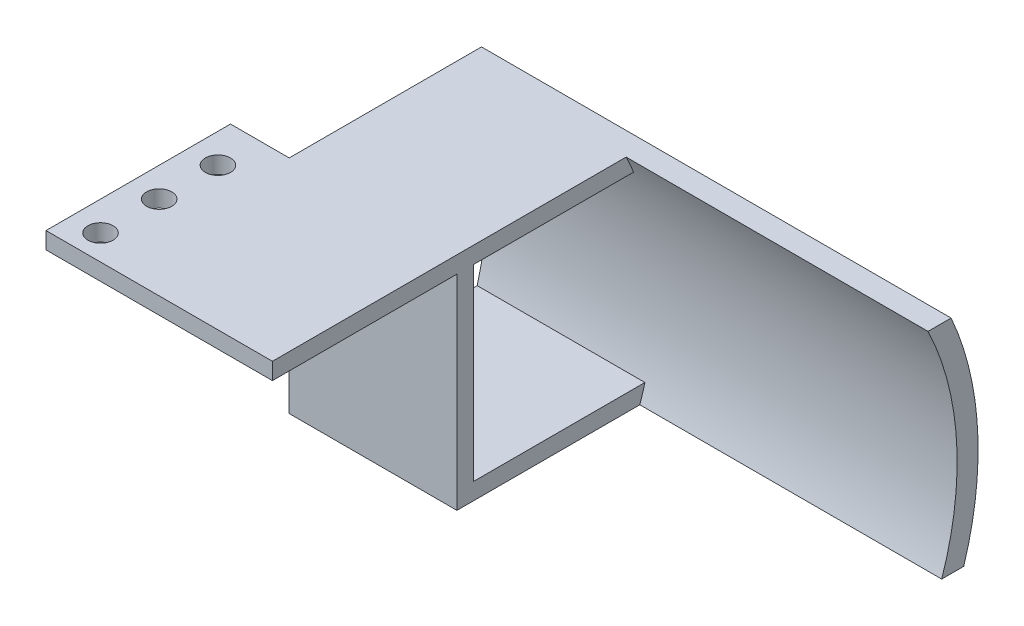
ISO-10303-21;
HEADER;
FILE_DESCRIPTION(('STEP AP214'),'2;1');
FILE_NAME('part.step','',(''),(''),'','','');
FILE_SCHEMA(('AUTOMOTIVE_DESIGN { 1 0 10303 214 1 1 1 1 }'));
ENDSEC;
DATA;
#1=APPLICATION_CONTEXT('core data for automotive mechanical design processes');
#2=APPLICATION_PROTOCOL_DEFINITION('international standard','automotive_design',2000,#1);
#3=PRODUCT_CONTEXT('',#1,'mechanical');
#4=PRODUCT('Part','Part','',(#3));
#5=PRODUCT_RELATED_PRODUCT_CATEGORY('part','',(#4));
#6=PRODUCT_DEFINITION_FORMATION('','',#4);
#7=PRODUCT_DEFINITION_CONTEXT('part definition',#1,'design');
#8=PRODUCT_DEFINITION('design','',#6,#7);
#9=PRODUCT_DEFINITION_SHAPE('','',#8);
#10=(LENGTH_UNIT() NAMED_UNIT(*) SI_UNIT(.MILLI.,.METRE.));
#11=(NAMED_UNIT(*) PLANE_ANGLE_UNIT() SI_UNIT($,.RADIAN.));
#12=(NAMED_UNIT(*) SI_UNIT($,.STERADIAN.) SOLID_ANGLE_UNIT());
#13=UNCERTAINTY_MEASURE_WITH_UNIT(LENGTH_MEASURE(1.E-05),#10,'distance_accuracy_value','');
#14=(GEOMETRIC_REPRESENTATION_CONTEXT(3) GLOBAL_UNCERTAINTY_ASSIGNED_CONTEXT((#13)) GLOBAL_UNIT_ASSIGNED_CONTEXT((#10,
#11,#12)) REPRESENTATION_CONTEXT('',''));
#15=CARTESIAN_POINT('',(0.,0.,0.));
#16=DIRECTION('',(0.,0.,1.));
#17=DIRECTION('',(1.,0.,0.));
#18=AXIS2_PLACEMENT_3D('',#15,#16,#17);
#19=CARTESIAN_POINT('',(0.,15.2,0.));
#20=DIRECTION('',(0.,-1.,0.));
#21=DIRECTION('',(0.,0.,-1.));
#22=AXIS2_PLACEMENT_3D('',#19,#20,#21);
#23=PLANE('',#22);
#24=DIRECTION('',(0.,0.,1.));
#25=VECTOR('',#24,1.);
#26=CARTESIAN_POINT('',(21.,15.2,-49.8500000000001));
#27=LINE('',#26,#25);
#28=CARTESIAN_POINT('',(21.,15.2,-71.8500000000001));
#29=VERTEX_POINT('',#28);
#30=CARTESIAN_POINT('',(21.,15.2,-49.8500000000001));
#31=VERTEX_POINT('',#30);
#32=EDGE_CURVE('E247',#29,#31,#27,.T.);
#33=ORIENTED_EDGE('',*,*,#32,.T.);
#34=DIRECTION('',(1.,0.,0.));
#35=VECTOR('',#34,1.);
#36=CARTESIAN_POINT('',(21.,15.2,-49.8500000000001));
#37=LINE('',#36,#35);
#38=CARTESIAN_POINT('',(48.,15.2,-49.8500000000001));
#39=VERTEX_POINT('',#38);
#40=EDGE_CURVE('E85',#31,#39,#37,.T.);
#41=ORIENTED_EDGE('',*,*,#40,.T.);
#42=DIRECTION('',(0.,0.,-1.));
#43=VECTOR('',#42,1.);
#44=CARTESIAN_POINT('',(48.,15.2,-49.8500000000001));
#45=LINE('',#44,#43);
#46=CARTESIAN_POINT('',(48.,15.2,-92.027131173007));
#47=VERTEX_POINT('',#46);
#48=EDGE_CURVE('E251',#39,#47,#45,.T.);
#49=ORIENTED_EDGE('',*,*,#48,.T.);
#50=DIRECTION('',(-1.,0.,0.));
#51=VECTOR('',#50,1.);
#52=CARTESIAN_POINT('',(84.,15.2,-92.027131173007));
#53=LINE('',#52,#51);
#54=CARTESIAN_POINT('',(84.,15.2,-92.027131173007));
#55=VERTEX_POINT('',#54);
#56=EDGE_CURVE('E168',#55,#47,#53,.T.);
#57=ORIENTED_EDGE('',*,*,#56,.F.);
#58=DIRECTION('',(0.,0.,-1.));
#59=VECTOR('',#58,1.);
#60=CARTESIAN_POINT('',(84.,15.2,0.));
#61=LINE('',#60,#59);
#62=CARTESIAN_POINT('',(84.,15.2,-94.781336029974));
#63=VERTEX_POINT('',#62);
#64=EDGE_CURVE('E161',#55,#63,#61,.T.);
#65=ORIENTED_EDGE('',*,*,#64,.T.);
#66=DIRECTION('',(-1.,0.,0.));
#67=VECTOR('',#66,1.);
#68=CARTESIAN_POINT('',(84.,15.2,-94.781336029974));
#69=LINE('',#68,#67);
#70=CARTESIAN_POINT('',(28.,15.2,-94.781336029974));
#71=VERTEX_POINT('',#70);
#72=EDGE_CURVE('E147',#63,#71,#69,.T.);
#73=ORIENTED_EDGE('',*,*,#72,.T.);
#74=DIRECTION('',(0.,0.,-1.));
#75=VECTOR('',#74,1.);
#76=CARTESIAN_POINT('',(28.,15.2,0.));
#77=LINE('',#76,#75);
#78=CARTESIAN_POINT('',(28.,15.2,-71.8500000000001));
#79=VERTEX_POINT('',#78);
#80=EDGE_CURVE('E178',#79,#71,#77,.T.);
#81=ORIENTED_EDGE('',*,*,#80,.F.);
#82=DIRECTION('',(-1.,0.,0.));
#83=VECTOR('',#82,1.);
#84=CARTESIAN_POINT('',(21.,15.2,-71.8500000000001));
#85=LINE('',#84,#83);
#86=EDGE_CURVE('E62',#79,#29,#85,.T.);
#87=ORIENTED_EDGE('',*,*,#86,.T.);
#88=EDGE_LOOP('',(#33,#41,#49,#57,#65,#73,#81,#87));
#89=FACE_BOUND('',#88,.T.);
#90=CARTESIAN_POINT('',(24.5,15.2,-59.8500000000001));
#91=DIRECTION('',(0.,1.,0.));
#92=DIRECTION('',(0.,0.,1.));
#93=AXIS2_PLACEMENT_3D('',#90,#91,#92);
#94=CIRCLE('',#93,1.5);
#95=CARTESIAN_POINT('',(24.5,15.2,-58.3500000000001));
#96=VERTEX_POINT('',#95);
#97=EDGE_CURVE('E241',#96,#96,#94,.T.);
#98=ORIENTED_EDGE('',*,*,#97,.F.);
#99=EDGE_LOOP('',(#98));
#100=FACE_BOUND('',#99,.T.);
#101=CARTESIAN_POINT('',(24.5,15.2,-66.8500000000001));
#102=DIRECTION('',(0.,1.,0.));
#103=DIRECTION('',(0.,0.,1.));
#104=AXIS2_PLACEMENT_3D('',#101,#102,#103);
#105=CIRCLE('',#104,1.5);
#106=CARTESIAN_POINT('',(24.5,15.2,-65.3500000000001));
#107=VERTEX_POINT('',#106);
#108=EDGE_CURVE('E235',#107,#107,#105,.T.);
#109=ORIENTED_EDGE('',*,*,#108,.F.);
#110=EDGE_LOOP('',(#109));
#111=FACE_BOUND('',#110,.T.);
#112=CARTESIAN_POINT('',(24.5,15.2,-52.8500000000001));
#113=DIRECTION('',(0.,1.,0.));
#114=DIRECTION('',(0.,0.,1.));
#115=AXIS2_PLACEMENT_3D('',#112,#113,#114);
#116=CIRCLE('',#115,1.5);
#117=CARTESIAN_POINT('',(24.5,15.2,-51.3500000000001));
#118=VERTEX_POINT('',#117);
#119=EDGE_CURVE('E229',#118,#118,#116,.T.);
#120=ORIENTED_EDGE('',*,*,#119,.F.);
#121=EDGE_LOOP('',(#120));
#122=FACE_BOUND('',#121,.T.);
#123=ADVANCED_FACE('F38',(#89,#100,#111,#122),#23,.F.);
#124=CARTESIAN_POINT('',(0.,13.2,0.));
#125=DIRECTION('',(0.,-1.,0.));
#126=DIRECTION('',(0.,0.,-1.));
#127=AXIS2_PLACEMENT_3D('',#124,#125,#126);
#128=PLANE('',#127);
#129=CARTESIAN_POINT('',(24.5,13.2,-66.8500000000001));
#130=DIRECTION('',(0.,1.,0.));
#131=DIRECTION('',(0.,0.,1.));
#132=AXIS2_PLACEMENT_3D('',#129,#130,#131);
#133=CIRCLE('',#132,1.5);
#134=CARTESIAN_POINT('',(24.5,13.2,-65.3500000000001));
#135=VERTEX_POINT('',#134);
#136=EDGE_CURVE('E232',#135,#135,#133,.T.);
#137=ORIENTED_EDGE('',*,*,#136,.T.);
#138=EDGE_LOOP('',(#137));
#139=FACE_BOUND('',#138,.T.);
#140=DIRECTION('',(0.,0.,1.));
#141=VECTOR('',#140,1.);
#142=CARTESIAN_POINT('',(21.,13.2,-49.8500000000001));
#143=LINE('',#142,#141);
#144=CARTESIAN_POINT('',(21.,13.2,-71.8500000000001));
#145=VERTEX_POINT('',#144);
#146=CARTESIAN_POINT('',(21.,13.2,-49.8500000000001));
#147=VERTEX_POINT('',#146);
#148=EDGE_CURVE('E244',#145,#147,#143,.T.);
#149=ORIENTED_EDGE('',*,*,#148,.F.);
#150=DIRECTION('',(-1.,0.,0.));
#151=VECTOR('',#150,1.);
#152=CARTESIAN_POINT('',(21.,13.2,-71.8500000000001));
#153=LINE('',#152,#151);
#154=CARTESIAN_POINT('',(28.,13.2,-71.8500000000001));
#155=VERTEX_POINT('',#154);
#156=EDGE_CURVE('E80',#155,#145,#153,.T.);
#157=ORIENTED_EDGE('',*,*,#156,.F.);
#158=CARTESIAN_POINT('',(48.,13.2,-71.8500000000001));
#159=VERTEX_POINT('',#158);
#160=EDGE_CURVE('E249',#159,#155,#153,.T.);
#161=ORIENTED_EDGE('',*,*,#160,.F.);
#162=DIRECTION('',(0.,0.,-1.));
#163=VECTOR('',#162,1.);
#164=CARTESIAN_POINT('',(48.,13.2,-49.8500000000001));
#165=LINE('',#164,#163);
#166=CARTESIAN_POINT('',(48.,13.2,-49.8500000000001));
#167=VERTEX_POINT('',#166);
#168=EDGE_CURVE('E259',#167,#159,#165,.T.);
#169=ORIENTED_EDGE('',*,*,#168,.F.);
#170=DIRECTION('',(1.,0.,0.));
#171=VECTOR('',#170,1.);
#172=CARTESIAN_POINT('',(21.,13.2,-49.8500000000001));
#173=LINE('',#172,#171);
#174=EDGE_CURVE('E257',#147,#167,#173,.T.);
#175=ORIENTED_EDGE('',*,*,#174,.F.);
#176=EDGE_LOOP('',(#149,#157,#161,#169,#175));
#177=FACE_BOUND('',#176,.T.);
#178=CARTESIAN_POINT('',(24.5,13.2,-59.8500000000001));
#179=DIRECTION('',(0.,1.,0.));
#180=DIRECTION('',(0.,0.,1.));
#181=AXIS2_PLACEMENT_3D('',#178,#179,#180);
#182=CIRCLE('',#181,1.5);
#183=CARTESIAN_POINT('',(24.5,13.2,-58.3500000000001));
#184=VERTEX_POINT('',#183);
#185=EDGE_CURVE('E238',#184,#184,#182,.T.);
#186=ORIENTED_EDGE('',*,*,#185,.T.);
#187=EDGE_LOOP('',(#186));
#188=FACE_BOUND('',#187,.T.);
#189=CARTESIAN_POINT('',(24.5,13.2,-52.8500000000001));
#190=DIRECTION('',(0.,1.,0.));
#191=DIRECTION('',(0.,0.,1.));
#192=AXIS2_PLACEMENT_3D('',#189,#190,#191);
#193=CIRCLE('',#192,1.5);
#194=CARTESIAN_POINT('',(24.5,13.2,-51.3500000000001));
#195=VERTEX_POINT('',#194);
#196=EDGE_CURVE('E219',#195,#195,#193,.T.);
#197=ORIENTED_EDGE('',*,*,#196,.T.);
#198=EDGE_LOOP('',(#197));
#199=FACE_BOUND('',#198,.T.);
#200=ADVANCED_FACE('F272',(#139,#177,#188,#199),#128,.T.);
#201=CARTESIAN_POINT('',(21.,15.2,-49.8500000000001));
#202=DIRECTION('',(1.,0.,0.));
#203=DIRECTION('',(0.,0.,-1.));
#204=AXIS2_PLACEMENT_3D('',#201,#202,#203);
#205=PLANE('',#204);
#206=ORIENTED_EDGE('',*,*,#148,.T.);
#207=DIRECTION('',(0.,-1.,0.));
#208=VECTOR('',#207,1.);
#209=CARTESIAN_POINT('',(21.,15.2,-49.8500000000001));
#210=LINE('',#209,#208);
#211=EDGE_CURVE('E11',#31,#147,#210,.T.);
#212=ORIENTED_EDGE('',*,*,#211,.F.);
#213=ORIENTED_EDGE('',*,*,#32,.F.);
#214=DIRECTION('',(0.,-1.,0.));
#215=VECTOR('',#214,1.);
#216=CARTESIAN_POINT('',(21.,15.2,-71.8500000000001));
#217=LINE('',#216,#215);
#218=EDGE_CURVE('E254',#29,#145,#217,.T.);
#219=ORIENTED_EDGE('',*,*,#218,.T.);
#220=EDGE_LOOP('',(#206,#212,#213,#219));
#221=FACE_BOUND('',#220,.T.);
#222=ADVANCED_FACE('F40',(#221),#205,.F.);
#223=CARTESIAN_POINT('',(21.,15.2,-49.8500000000001));
#224=DIRECTION('',(0.,0.,-1.));
#225=DIRECTION('',(0.,1.,0.));
#226=AXIS2_PLACEMENT_3D('',#223,#224,#225);
#227=PLANE('',#226);
#228=ORIENTED_EDGE('',*,*,#174,.T.);
#229=DIRECTION('',(0.,-1.,0.));
#230=VECTOR('',#229,1.);
#231=CARTESIAN_POINT('',(48.,15.2,-49.8500000000001));
#232=LINE('',#231,#230);
#233=EDGE_CURVE('E46',#39,#167,#232,.T.);
#234=ORIENTED_EDGE('',*,*,#233,.F.);
#235=ORIENTED_EDGE('',*,*,#40,.F.);
#236=ORIENTED_EDGE('',*,*,#211,.T.);
#237=EDGE_LOOP('',(#228,#234,#235,#236));
#238=FACE_BOUND('',#237,.T.);
#239=ADVANCED_FACE('F302',(#238),#227,.F.);
#240=CARTESIAN_POINT('',(48.,15.2,-49.8500000000001));
#241=DIRECTION('',(-1.,0.,0.));
#242=DIRECTION('',(0.,0.,1.));
#243=AXIS2_PLACEMENT_3D('',#240,#241,#242);
#244=PLANE('',#243);
#245=ORIENTED_EDGE('',*,*,#168,.T.);
#246=DIRECTION('',(0.,-1.,0.));
#247=VECTOR('',#246,1.);
#248=CARTESIAN_POINT('',(48.,0.,-71.8500000000001));
#249=LINE('',#248,#247);
#250=CARTESIAN_POINT('',(48.,-11.2,-71.8500000000001));
#251=VERTEX_POINT('',#250);
#252=EDGE_CURVE('E200',#159,#251,#249,.T.);
#253=ORIENTED_EDGE('',*,*,#252,.T.);
#254=DIRECTION('',(0.,0.,-1.));
#255=VECTOR('',#254,1.);
#256=CARTESIAN_POINT('',(48.,-11.2,0.));
#257=LINE('',#256,#255);
#258=CARTESIAN_POINT('',(48.,-11.2,-93.6596139905156));
#259=VERTEX_POINT('',#258);
#260=EDGE_CURVE('E197',#251,#259,#257,.T.);
#261=ORIENTED_EDGE('',*,*,#260,.T.);
#262=CARTESIAN_POINT('',(48.,-1.67790586170717E-13,-60.4999999999999));
#263=DIRECTION('',(-1.,0.,0.));
#264=DIRECTION('',(0.,-1.,0.));
#265=AXIS2_PLACEMENT_3D('',#262,#263,#264);
#266=CIRCLE('',#265,35.);
#267=CARTESIAN_POINT('',(48.,-9.20000000000031,-94.269216751355));
#268=VERTEX_POINT('',#267);
#269=EDGE_CURVE('E195',#268,#259,#266,.T.);
#270=ORIENTED_EDGE('',*,*,#269,.F.);
#271=DIRECTION('',(0.,0.,-1.));
#272=VECTOR('',#271,1.);
#273=CARTESIAN_POINT('',(48.,-9.2000000000003,0.));
#274=LINE('',#273,#272);
#275=CARTESIAN_POINT('',(48.,-9.20000000000031,-73.8500000000001));
#276=VERTEX_POINT('',#275);
#277=EDGE_CURVE('E192',#276,#268,#274,.T.);
#278=ORIENTED_EDGE('',*,*,#277,.F.);
#279=DIRECTION('',(0.,-1.,0.));
#280=VECTOR('',#279,1.);
#281=CARTESIAN_POINT('',(48.,0.,-73.8500000000001));
#282=LINE('',#281,#280);
#283=CARTESIAN_POINT('',(48.,13.2,-73.8500000000001));
#284=VERTEX_POINT('',#283);
#285=EDGE_CURVE('E189',#284,#276,#282,.T.);
#286=ORIENTED_EDGE('',*,*,#285,.F.);
#287=DIRECTION('',(0.,0.,-1.));
#288=VECTOR('',#287,1.);
#289=CARTESIAN_POINT('',(48.,13.2,0.));
#290=LINE('',#289,#288);
#291=CARTESIAN_POINT('',(48.,13.2,-92.9154284253655));
#292=VERTEX_POINT('',#291);
#293=EDGE_CURVE('E185',#284,#292,#290,.T.);
#294=ORIENTED_EDGE('',*,*,#293,.T.);
#295=CARTESIAN_POINT('',(48.,-1.67790586170717E-13,-60.4999999999999));
#296=DIRECTION('',(-1.,0.,0.));
#297=DIRECTION('',(0.,-1.,0.));
#298=AXIS2_PLACEMENT_3D('',#295,#296,#297);
#299=CIRCLE('',#298,35.);
#300=EDGE_CURVE('E183',#47,#292,#299,.T.);
#301=ORIENTED_EDGE('',*,*,#300,.F.);
#302=ORIENTED_EDGE('',*,*,#48,.F.);
#303=ORIENTED_EDGE('',*,*,#233,.T.);
#304=EDGE_LOOP('',(#245,#253,#261,#270,#278,#286,#294,#301,#302,#303));
#305=FACE_BOUND('',#304,.T.);
#306=ADVANCED_FACE('F267',(#305),#244,.F.);
#307=CARTESIAN_POINT('',(21.,15.2,-71.8500000000001));
#308=DIRECTION('',(0.,0.,1.));
#309=DIRECTION('',(0.,-1.,0.));
#310=AXIS2_PLACEMENT_3D('',#307,#308,#309);
#311=PLANE('',#310);
#312=ORIENTED_EDGE('',*,*,#86,.F.);
#313=DIRECTION('',(0.,-1.,0.));
#314=VECTOR('',#313,1.);
#315=CARTESIAN_POINT('',(28.,0.,-71.8500000000001));
#316=LINE('',#315,#314);
#317=EDGE_CURVE('E186',#79,#155,#316,.T.);
#318=ORIENTED_EDGE('',*,*,#317,.T.);
#319=ORIENTED_EDGE('',*,*,#156,.T.);
#320=ORIENTED_EDGE('',*,*,#218,.F.);
#321=EDGE_LOOP('',(#312,#318,#319,#320));
#322=FACE_BOUND('',#321,.T.);
#323=ADVANCED_FACE('F277',(#322),#311,.F.);
#324=CARTESIAN_POINT('',(24.5,15.2,-59.8500000000001));
#325=DIRECTION('',(0.,-1.,0.));
#326=DIRECTION('',(0.,0.,-1.));
#327=AXIS2_PLACEMENT_3D('',#324,#325,#326);
#328=CYLINDRICAL_SURFACE('',#327,1.5);
#329=ORIENTED_EDGE('',*,*,#97,.T.);
#330=EDGE_LOOP('',(#329));
#331=FACE_BOUND('',#330,.T.);
#332=ORIENTED_EDGE('',*,*,#185,.F.);
#333=EDGE_LOOP('',(#332));
#334=FACE_BOUND('',#333,.T.);
#335=ADVANCED_FACE('F317',(#331,#334),#328,.F.);
#336=CARTESIAN_POINT('',(24.5,15.2,-66.8500000000001));
#337=DIRECTION('',(0.,-1.,0.));
#338=DIRECTION('',(0.,0.,-1.));
#339=AXIS2_PLACEMENT_3D('',#336,#337,#338);
#340=CYLINDRICAL_SURFACE('',#339,1.5);
#341=ORIENTED_EDGE('',*,*,#108,.T.);
#342=EDGE_LOOP('',(#341));
#343=FACE_BOUND('',#342,.T.);
#344=ORIENTED_EDGE('',*,*,#136,.F.);
#345=EDGE_LOOP('',(#344));
#346=FACE_BOUND('',#345,.T.);
#347=ADVANCED_FACE('F324',(#343,#346),#340,.F.);
#348=CARTESIAN_POINT('',(24.5,15.2,-52.8500000000001));
#349=DIRECTION('',(0.,-1.,0.));
#350=DIRECTION('',(0.,0.,-1.));
#351=AXIS2_PLACEMENT_3D('',#348,#349,#350);
#352=CYLINDRICAL_SURFACE('',#351,1.5);
#353=ORIENTED_EDGE('',*,*,#119,.T.);
#354=EDGE_LOOP('',(#353));
#355=FACE_BOUND('',#354,.T.);
#356=ORIENTED_EDGE('',*,*,#196,.F.);
#357=EDGE_LOOP('',(#356));
#358=FACE_BOUND('',#357,.T.);
#359=ADVANCED_FACE('F329',(#355,#358),#352,.F.);
#360=CARTESIAN_POINT('',(48.,0.,-71.8500000000001));
#361=DIRECTION('',(0.,0.,-1.));
#362=DIRECTION('',(-1.,0.,0.));
#363=AXIS2_PLACEMENT_3D('',#360,#361,#362);
#364=PLANE('',#363);
#365=ORIENTED_EDGE('',*,*,#252,.F.);
#366=ORIENTED_EDGE('',*,*,#160,.T.);
#367=CARTESIAN_POINT('',(28.,-11.2,-71.8500000000001));
#368=VERTEX_POINT('',#367);
#369=EDGE_CURVE('E53',#155,#368,#316,.T.);
#370=ORIENTED_EDGE('',*,*,#369,.T.);
#371=DIRECTION('',(-1.,0.,0.));
#372=VECTOR('',#371,1.);
#373=CARTESIAN_POINT('',(48.,-11.2,-71.8500000000001));
#374=LINE('',#373,#372);
#375=EDGE_CURVE('E216',#251,#368,#374,.T.);
#376=ORIENTED_EDGE('',*,*,#375,.F.);
#377=EDGE_LOOP('',(#365,#366,#370,#376));
#378=FACE_BOUND('',#377,.T.);
#379=ADVANCED_FACE('F275',(#378),#364,.F.);
#380=CARTESIAN_POINT('',(48.,-11.2,0.));
#381=DIRECTION('',(0.,1.,0.));
#382=DIRECTION('',(-1.,0.,0.));
#383=AXIS2_PLACEMENT_3D('',#380,#381,#382);
#384=PLANE('',#383);
#385=DIRECTION('',(0.,0.,-1.));
#386=VECTOR('',#385,1.);
#387=CARTESIAN_POINT('',(28.,-11.2,0.));
#388=LINE('',#387,#386);
#389=CARTESIAN_POINT('',(28.,-11.2,-96.2884059438248));
#390=VERTEX_POINT('',#389);
#391=EDGE_CURVE('E213',#368,#390,#388,.T.);
#392=ORIENTED_EDGE('',*,*,#391,.T.);
#393=DIRECTION('',(-1.,0.,0.));
#394=VECTOR('',#393,1.);
#395=CARTESIAN_POINT('',(84.,-11.2,-96.2884059438248));
#396=LINE('',#395,#394);
#397=CARTESIAN_POINT('',(84.,-11.2,-96.2884059438248));
#398=VERTEX_POINT('',#397);
#399=EDGE_CURVE('E155',#398,#390,#396,.T.);
#400=ORIENTED_EDGE('',*,*,#399,.F.);
#401=DIRECTION('',(0.,0.,-1.));
#402=VECTOR('',#401,1.);
#403=CARTESIAN_POINT('',(84.,-11.2,0.));
#404=LINE('',#403,#402);
#405=CARTESIAN_POINT('',(84.,-11.2,-93.6596139905156));
#406=VERTEX_POINT('',#405);
#407=EDGE_CURVE('E163',#406,#398,#404,.T.);
#408=ORIENTED_EDGE('',*,*,#407,.F.);
#409=DIRECTION('',(-1.,0.,0.));
#410=VECTOR('',#409,1.);
#411=CARTESIAN_POINT('',(84.,-11.2,-93.6596139905156));
#412=LINE('',#411,#410);
#413=EDGE_CURVE('E179',#406,#259,#412,.T.);
#414=ORIENTED_EDGE('',*,*,#413,.T.);
#415=ORIENTED_EDGE('',*,*,#260,.F.);
#416=ORIENTED_EDGE('',*,*,#375,.T.);
#417=EDGE_LOOP('',(#392,#400,#408,#414,#415,#416));
#418=FACE_BOUND('',#417,.T.);
#419=ADVANCED_FACE('F280',(#418),#384,.F.);
#420=CARTESIAN_POINT('',(48.,-9.2000000000003,0.));
#421=DIRECTION('',(0.,1.,0.));
#422=DIRECTION('',(-1.,0.,0.));
#423=AXIS2_PLACEMENT_3D('',#420,#421,#422);
#424=PLANE('',#423);
#425=DIRECTION('',(0.,0.,-1.));
#426=VECTOR('',#425,1.);
#427=CARTESIAN_POINT('',(28.,-9.20000000000029,0.));
#428=LINE('',#427,#426);
#429=CARTESIAN_POINT('',(28.,-9.2000000000003,-73.8500000000001));
#430=VERTEX_POINT('',#429);
#431=CARTESIAN_POINT('',(28.,-9.2000000000003,-94.269216751355));
#432=VERTEX_POINT('',#431);
#433=EDGE_CURVE('E210',#430,#432,#428,.T.);
#434=ORIENTED_EDGE('',*,*,#433,.F.);
#435=DIRECTION('',(-1.,0.,0.));
#436=VECTOR('',#435,1.);
#437=CARTESIAN_POINT('',(48.,-9.20000000000031,-73.8500000000001));
#438=LINE('',#437,#436);
#439=EDGE_CURVE('E223',#276,#430,#438,.T.);
#440=ORIENTED_EDGE('',*,*,#439,.F.);
#441=ORIENTED_EDGE('',*,*,#277,.T.);
#442=DIRECTION('',(-1.,0.,0.));
#443=VECTOR('',#442,1.);
#444=CARTESIAN_POINT('',(48.,-9.20000000000031,-94.269216751355));
#445=LINE('',#444,#443);
#446=EDGE_CURVE('E220',#268,#432,#445,.T.);
#447=ORIENTED_EDGE('',*,*,#446,.T.);
#448=EDGE_LOOP('',(#434,#440,#441,#447));
#449=FACE_BOUND('',#448,.T.);
#450=ADVANCED_FACE('F289',(#449),#424,.T.);
#451=CARTESIAN_POINT('',(48.,0.,-73.8500000000001));
#452=DIRECTION('',(0.,0.,-1.));
#453=DIRECTION('',(-1.,0.,0.));
#454=AXIS2_PLACEMENT_3D('',#451,#452,#453);
#455=PLANE('',#454);
#456=DIRECTION('',(0.,-1.,0.));
#457=VECTOR('',#456,1.);
#458=CARTESIAN_POINT('',(28.,0.,-73.8500000000001));
#459=LINE('',#458,#457);
#460=CARTESIAN_POINT('',(28.,13.2,-73.8500000000001));
#461=VERTEX_POINT('',#460);
#462=EDGE_CURVE('E207',#461,#430,#459,.T.);
#463=ORIENTED_EDGE('',*,*,#462,.F.);
#464=DIRECTION('',(-1.,0.,0.));
#465=VECTOR('',#464,1.);
#466=CARTESIAN_POINT('',(48.,13.2,-73.8500000000001));
#467=LINE('',#466,#465);
#468=EDGE_CURVE('E225',#284,#461,#467,.T.);
#469=ORIENTED_EDGE('',*,*,#468,.F.);
#470=ORIENTED_EDGE('',*,*,#285,.T.);
#471=ORIENTED_EDGE('',*,*,#439,.T.);
#472=EDGE_LOOP('',(#463,#469,#470,#471));
#473=FACE_BOUND('',#472,.T.);
#474=ADVANCED_FACE('F292',(#473),#455,.T.);
#475=CARTESIAN_POINT('',(48.,13.2,0.));
#476=DIRECTION('',(0.,1.,0.));
#477=DIRECTION('',(-1.,0.,0.));
#478=AXIS2_PLACEMENT_3D('',#475,#476,#477);
#479=PLANE('',#478);
#480=DIRECTION('',(0.,0.,-1.));
#481=VECTOR('',#480,1.);
#482=CARTESIAN_POINT('',(28.,13.2,0.));
#483=LINE('',#482,#481);
#484=CARTESIAN_POINT('',(28.,13.2,-92.9154284253655));
#485=VERTEX_POINT('',#484);
#486=EDGE_CURVE('E204',#461,#485,#483,.T.);
#487=ORIENTED_EDGE('',*,*,#486,.T.);
#488=DIRECTION('',(-1.,0.,0.));
#489=VECTOR('',#488,1.);
#490=CARTESIAN_POINT('',(48.,13.2,-92.9154284253655));
#491=LINE('',#490,#489);
#492=EDGE_CURVE('E202',#292,#485,#491,.T.);
#493=ORIENTED_EDGE('',*,*,#492,.F.);
#494=ORIENTED_EDGE('',*,*,#293,.F.);
#495=ORIENTED_EDGE('',*,*,#468,.T.);
#496=EDGE_LOOP('',(#487,#493,#494,#495));
#497=FACE_BOUND('',#496,.T.);
#498=ADVANCED_FACE('F296',(#497),#479,.F.);
#499=CARTESIAN_POINT('',(28.,0.,0.));
#500=DIRECTION('',(-1.,0.,0.));
#501=DIRECTION('',(0.,-1.,0.));
#502=AXIS2_PLACEMENT_3D('',#499,#500,#501);
#503=PLANE('',#502);
#504=CARTESIAN_POINT('',(28.,-1.60413984605757E-13,-60.4999999999999));
#505=DIRECTION('',(-1.,0.,0.));
#506=DIRECTION('',(0.,-1.,0.));
#507=AXIS2_PLACEMENT_3D('',#504,#505,#506);
#508=CIRCLE('',#507,35.);
#509=EDGE_CURVE('E170',#485,#432,#508,.T.);
#510=ORIENTED_EDGE('',*,*,#509,.F.);
#511=ORIENTED_EDGE('',*,*,#486,.F.);
#512=ORIENTED_EDGE('',*,*,#462,.T.);
#513=ORIENTED_EDGE('',*,*,#433,.T.);
#514=EDGE_LOOP('',(#510,#511,#512,#513));
#515=FACE_BOUND('',#514,.T.);
#516=ORIENTED_EDGE('',*,*,#80,.T.);
#517=CARTESIAN_POINT('',(28.,-1.60413984605757E-13,-60.4999999999999));
#518=DIRECTION('',(-1.,0.,0.));
#519=DIRECTION('',(0.,-1.,0.));
#520=AXIS2_PLACEMENT_3D('',#517,#518,#519);
#521=CIRCLE('',#520,37.5);
#522=EDGE_CURVE('E153',#71,#390,#521,.T.);
#523=ORIENTED_EDGE('',*,*,#522,.T.);
#524=ORIENTED_EDGE('',*,*,#391,.F.);
#525=ORIENTED_EDGE('',*,*,#369,.F.);
#526=ORIENTED_EDGE('',*,*,#317,.F.);
#527=EDGE_LOOP('',(#516,#523,#524,#525,#526));
#528=FACE_BOUND('',#527,.T.);
#529=ADVANCED_FACE('F278',(#515,#528),#503,.T.);
#530=CARTESIAN_POINT('',(84.,-1.81068468987646E-13,-60.4999999999999));
#531=DIRECTION('',(-1.,0.,0.));
#532=DIRECTION('',(0.,-1.,0.));
#533=AXIS2_PLACEMENT_3D('',#530,#531,#532);
#534=CYLINDRICAL_SURFACE('',#533,35.);
#535=ORIENTED_EDGE('',*,*,#446,.F.);
#536=ORIENTED_EDGE('',*,*,#269,.T.);
#537=ORIENTED_EDGE('',*,*,#413,.F.);
#538=CARTESIAN_POINT('',(84.,-1.81068468987646E-13,-60.4999999999999));
#539=DIRECTION('',(-1.,0.,0.));
#540=DIRECTION('',(0.,-1.,0.));
#541=AXIS2_PLACEMENT_3D('',#538,#539,#540);
#542=CIRCLE('',#541,35.);
#543=EDGE_CURVE('E156',#55,#406,#542,.T.);
#544=ORIENTED_EDGE('',*,*,#543,.F.);
#545=ORIENTED_EDGE('',*,*,#56,.T.);
#546=ORIENTED_EDGE('',*,*,#300,.T.);
#547=ORIENTED_EDGE('',*,*,#492,.T.);
#548=ORIENTED_EDGE('',*,*,#509,.T.);
#549=EDGE_LOOP('',(#535,#536,#537,#544,#545,#546,#547,#548));
#550=FACE_BOUND('',#549,.T.);
#551=ADVANCED_FACE('F298',(#550),#534,.F.);
#552=CARTESIAN_POINT('',(84.,-1.81068468987646E-13,-60.4999999999999));
#553=DIRECTION('',(-1.,0.,0.));
#554=DIRECTION('',(0.,-1.,0.));
#555=AXIS2_PLACEMENT_3D('',#552,#553,#554);
#556=CYLINDRICAL_SURFACE('',#555,37.5);
#557=ORIENTED_EDGE('',*,*,#522,.F.);
#558=ORIENTED_EDGE('',*,*,#72,.F.);
#559=CARTESIAN_POINT('',(84.,-1.81068468987646E-13,-60.4999999999999));
#560=DIRECTION('',(-1.,0.,0.));
#561=DIRECTION('',(0.,-1.,0.));
#562=AXIS2_PLACEMENT_3D('',#559,#560,#561);
#563=CIRCLE('',#562,37.5);
#564=EDGE_CURVE('E151',#63,#398,#563,.T.);
#565=ORIENTED_EDGE('',*,*,#564,.T.);
#566=ORIENTED_EDGE('',*,*,#399,.T.);
#567=EDGE_LOOP('',(#557,#558,#565,#566));
#568=FACE_BOUND('',#567,.T.);
#569=ADVANCED_FACE('F149',(#568),#556,.T.);
#570=CARTESIAN_POINT('',(84.,0.,0.));
#571=DIRECTION('',(-1.,0.,0.));
#572=DIRECTION('',(0.,-1.,0.));
#573=AXIS2_PLACEMENT_3D('',#570,#571,#572);
#574=PLANE('',#573);
#575=ORIENTED_EDGE('',*,*,#64,.F.);
#576=ORIENTED_EDGE('',*,*,#543,.T.);
#577=ORIENTED_EDGE('',*,*,#407,.T.);
#578=ORIENTED_EDGE('',*,*,#564,.F.);
#579=EDGE_LOOP('',(#575,#576,#577,#578));
#580=FACE_BOUND('',#579,.T.);
#581=ADVANCED_FACE('F160',(#580),#574,.F.);
#582=CLOSED_SHELL('',(#123,#200,#222,#239,#306,#323,#335,#347,#359,#379,#419,#450,#474,#498,
#529,#551,#569,#581));
#583=MANIFOLD_SOLID_BREP('B2',#582);
#584=ADVANCED_BREP_SHAPE_REPRESENTATION('',(#18,#583),#14);
#585=SHAPE_DEFINITION_REPRESENTATION(#9,#584);
ENDSEC;
END-ISO-10303-21;
